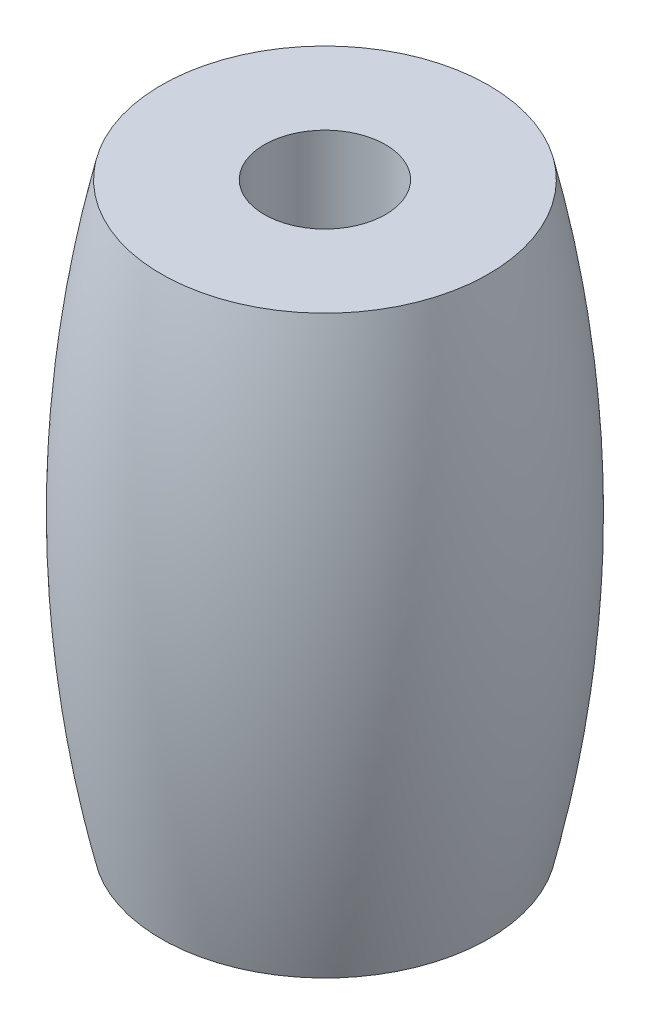
ISO-10303-21;
HEADER;
FILE_DESCRIPTION(('STEP AP214'),'2;1');
FILE_NAME('part.step','',(''),(''),'','','');
FILE_SCHEMA(('AUTOMOTIVE_DESIGN { 1 0 10303 214 1 1 1 1 }'));
ENDSEC;
DATA;
#1=APPLICATION_CONTEXT('core data for automotive mechanical design processes');
#2=APPLICATION_PROTOCOL_DEFINITION('international standard','automotive_design',2000,#1);
#3=PRODUCT_CONTEXT('',#1,'mechanical');
#4=PRODUCT('Part','Part','',(#3));
#5=PRODUCT_RELATED_PRODUCT_CATEGORY('part','',(#4));
#6=PRODUCT_DEFINITION_FORMATION('','',#4);
#7=PRODUCT_DEFINITION_CONTEXT('part definition',#1,'design');
#8=PRODUCT_DEFINITION('design','',#6,#7);
#9=PRODUCT_DEFINITION_SHAPE('','',#8);
#10=(LENGTH_UNIT() NAMED_UNIT(*) SI_UNIT(.MILLI.,.METRE.));
#11=(NAMED_UNIT(*) PLANE_ANGLE_UNIT() SI_UNIT($,.RADIAN.));
#12=(NAMED_UNIT(*) SI_UNIT($,.STERADIAN.) SOLID_ANGLE_UNIT());
#13=UNCERTAINTY_MEASURE_WITH_UNIT(LENGTH_MEASURE(1.E-05),#10,'distance_accuracy_value','');
#14=(GEOMETRIC_REPRESENTATION_CONTEXT(3) GLOBAL_UNCERTAINTY_ASSIGNED_CONTEXT((#13)) GLOBAL_UNIT_ASSIGNED_CONTEXT((#10,
#11,#12)) REPRESENTATION_CONTEXT('',''));
#15=CARTESIAN_POINT('',(0.,0.,0.));
#16=DIRECTION('',(0.,0.,1.));
#17=DIRECTION('',(1.,0.,0.));
#18=AXIS2_PLACEMENT_3D('',#15,#16,#17);
#19=CARTESIAN_POINT('',(2.,19.,0.));
#20=DIRECTION('',(0.,1.,0.));
#21=DIRECTION('',(0.,0.,1.));
#22=AXIS2_PLACEMENT_3D('',#19,#20,#21);
#23=PLANE('',#22);
#24=CARTESIAN_POINT('',(0.,19.,0.));
#25=DIRECTION('',(0.,-1.,0.));
#26=DIRECTION('',(0.,0.,-1.));
#27=AXIS2_PLACEMENT_3D('',#24,#25,#26);
#28=CIRCLE('',#27,2.);
#29=CARTESIAN_POINT('',(0.,19.,-2.));
#30=VERTEX_POINT('',#29);
#31=EDGE_CURVE('E10',#30,#30,#28,.T.);
#32=ORIENTED_EDGE('',*,*,#31,.T.);
#33=EDGE_LOOP('',(#32));
#34=FACE_BOUND('',#33,.T.);
#35=CARTESIAN_POINT('',(0.,19.,0.));
#36=DIRECTION('',(0.,-1.,0.));
#37=DIRECTION('',(0.,0.,-1.));
#38=AXIS2_PLACEMENT_3D('',#35,#36,#37);
#39=CIRCLE('',#38,5.4);
#40=CARTESIAN_POINT('',(0.,19.,-5.4));
#41=VERTEX_POINT('',#40);
#42=EDGE_CURVE('E44',#41,#41,#39,.T.);
#43=ORIENTED_EDGE('',*,*,#42,.F.);
#44=EDGE_LOOP('',(#43));
#45=FACE_BOUND('',#44,.T.);
#46=ADVANCED_FACE('F30',(#34,#45),#23,.T.);
#47=CARTESIAN_POINT('',(0.,0.,0.));
#48=DIRECTION('',(0.,-1.,0.));
#49=DIRECTION('',(0.,0.,-1.));
#50=AXIS2_PLACEMENT_3D('',#47,#48,#49);
#51=CYLINDRICAL_SURFACE('',#50,2.);
#52=CARTESIAN_POINT('',(0.,0.,0.));
#53=DIRECTION('',(0.,-1.,0.));
#54=DIRECTION('',(0.,0.,-1.));
#55=AXIS2_PLACEMENT_3D('',#52,#53,#54);
#56=CIRCLE('',#55,2.);
#57=CARTESIAN_POINT('',(0.,0.,-2.));
#58=VERTEX_POINT('',#57);
#59=EDGE_CURVE('E36',#58,#58,#56,.T.);
#60=ORIENTED_EDGE('',*,*,#59,.T.);
#61=EDGE_LOOP('',(#60));
#62=FACE_BOUND('',#61,.T.);
#63=ORIENTED_EDGE('',*,*,#31,.F.);
#64=EDGE_LOOP('',(#63));
#65=FACE_BOUND('',#64,.T.);
#66=ADVANCED_FACE('F62',(#62,#65),#51,.F.);
#67=CARTESIAN_POINT('',(2.,0.,0.));
#68=DIRECTION('',(0.,-1.,0.));
#69=DIRECTION('',(0.,0.,-1.));
#70=AXIS2_PLACEMENT_3D('',#67,#68,#69);
#71=PLANE('',#70);
#72=CARTESIAN_POINT('',(0.,0.,0.));
#73=DIRECTION('',(0.,-1.,0.));
#74=DIRECTION('',(0.,0.,-1.));
#75=AXIS2_PLACEMENT_3D('',#72,#73,#74);
#76=CIRCLE('',#75,5.4);
#77=CARTESIAN_POINT('',(0.,0.,-5.4));
#78=VERTEX_POINT('',#77);
#79=EDGE_CURVE('E40',#78,#78,#76,.T.);
#80=ORIENTED_EDGE('',*,*,#79,.T.);
#81=EDGE_LOOP('',(#80));
#82=FACE_BOUND('',#81,.T.);
#83=ORIENTED_EDGE('',*,*,#59,.F.);
#84=EDGE_LOOP('',(#83));
#85=FACE_BOUND('',#84,.T.);
#86=ADVANCED_FACE('F59',(#82,#85),#71,.T.);
#87=CARTESIAN_POINT('',(5.4,0.,0.));
#88=CARTESIAN_POINT('',(7.6,9.5,0.));
#89=CARTESIAN_POINT('',(5.4,19.,0.));
#90=B_SPLINE_CURVE_WITH_KNOTS('',2,(#87,#88,#89),.UNSPECIFIED.,.F.,.F.,(3,3),(0.,1.),.UNSPECIFIED.);
#91=CARTESIAN_POINT('',(0.,0.,0.));
#92=DIRECTION('',(0.,-1.,0.));
#93=AXIS1_PLACEMENT('',#91,#92);
#94=SURFACE_OF_REVOLUTION('',#90,#93);
#95=ORIENTED_EDGE('',*,*,#42,.T.);
#96=EDGE_LOOP('',(#95));
#97=FACE_BOUND('',#96,.T.);
#98=ORIENTED_EDGE('',*,*,#79,.F.);
#99=EDGE_LOOP('',(#98));
#100=FACE_BOUND('',#99,.T.);
#101=ADVANCED_FACE('F56',(#97,#100),#94,.F.);
#102=CLOSED_SHELL('',(#46,#66,#86,#101));
#103=MANIFOLD_SOLID_BREP('B2',#102);
#104=ADVANCED_BREP_SHAPE_REPRESENTATION('',(#18,#103),#14);
#105=SHAPE_DEFINITION_REPRESENTATION(#9,#104);
ENDSEC;
END-ISO-10303-21;
